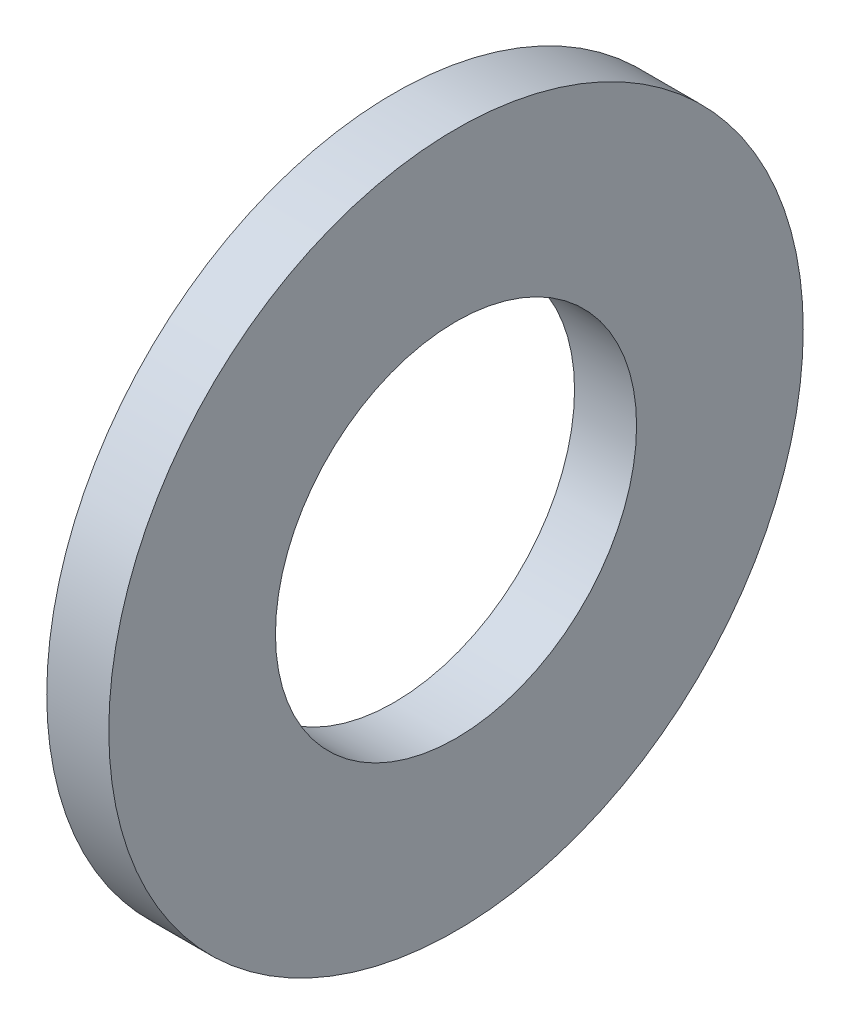
ISO-10303-21;
HEADER;
FILE_DESCRIPTION(('STEP AP214'),'2;1');
FILE_NAME('part.step','',(''),(''),'','','');
FILE_SCHEMA(('AUTOMOTIVE_DESIGN { 1 0 10303 214 1 1 1 1 }'));
ENDSEC;
DATA;
#1=APPLICATION_CONTEXT('core data for automotive mechanical design processes');
#2=APPLICATION_PROTOCOL_DEFINITION('international standard','automotive_design',2000,#1);
#3=PRODUCT_CONTEXT('',#1,'mechanical');
#4=PRODUCT('Part','Part','',(#3));
#5=PRODUCT_RELATED_PRODUCT_CATEGORY('part','',(#4));
#6=PRODUCT_DEFINITION_FORMATION('','',#4);
#7=PRODUCT_DEFINITION_CONTEXT('part definition',#1,'design');
#8=PRODUCT_DEFINITION('design','',#6,#7);
#9=PRODUCT_DEFINITION_SHAPE('','',#8);
#10=(LENGTH_UNIT() NAMED_UNIT(*) SI_UNIT(.MILLI.,.METRE.));
#11=(NAMED_UNIT(*) PLANE_ANGLE_UNIT() SI_UNIT($,.RADIAN.));
#12=(NAMED_UNIT(*) SI_UNIT($,.STERADIAN.) SOLID_ANGLE_UNIT());
#13=UNCERTAINTY_MEASURE_WITH_UNIT(LENGTH_MEASURE(1.E-05),#10,'distance_accuracy_value','');
#14=(GEOMETRIC_REPRESENTATION_CONTEXT(3) GLOBAL_UNCERTAINTY_ASSIGNED_CONTEXT((#13)) GLOBAL_UNIT_ASSIGNED_CONTEXT((#10,
#11,#12)) REPRESENTATION_CONTEXT('',''));
#15=CARTESIAN_POINT('',(0.,0.,0.));
#16=DIRECTION('',(0.,0.,1.));
#17=DIRECTION('',(1.,0.,0.));
#18=AXIS2_PLACEMENT_3D('',#15,#16,#17);
#19=CARTESIAN_POINT('',(1.7018,0.,0.));
#20=DIRECTION('',(1.,0.,0.));
#21=DIRECTION('',(0.,0.,-1.));
#22=AXIS2_PLACEMENT_3D('',#19,#20,#21);
#23=PLANE('',#22);
#24=CARTESIAN_POINT('',(1.7018,0.,0.));
#25=DIRECTION('',(1.,0.,0.));
#26=DIRECTION('',(0.,0.,-1.));
#27=AXIS2_PLACEMENT_3D('',#24,#25,#26);
#28=CIRCLE('',#27,9.525);
#29=CARTESIAN_POINT('',(1.7018,0.,-9.525));
#30=VERTEX_POINT('',#29);
#31=EDGE_CURVE('E10',#30,#30,#28,.T.);
#32=ORIENTED_EDGE('',*,*,#31,.T.);
#33=EDGE_LOOP('',(#32));
#34=FACE_BOUND('',#33,.T.);
#35=CARTESIAN_POINT('',(1.7018,0.,0.));
#36=DIRECTION('',(1.,0.,0.));
#37=DIRECTION('',(0.,0.,-1.));
#38=AXIS2_PLACEMENT_3D('',#35,#36,#37);
#39=CIRCLE('',#38,4.953);
#40=CARTESIAN_POINT('',(1.7018,0.,-4.953));
#41=VERTEX_POINT('',#40);
#42=EDGE_CURVE('E40',#41,#41,#39,.T.);
#43=ORIENTED_EDGE('',*,*,#42,.F.);
#44=EDGE_LOOP('',(#43));
#45=FACE_BOUND('',#44,.T.);
#46=ADVANCED_FACE('F29',(#34,#45),#23,.T.);
#47=CARTESIAN_POINT('',(0.,0.,0.));
#48=DIRECTION('',(1.,0.,0.));
#49=DIRECTION('',(0.,0.,-1.));
#50=AXIS2_PLACEMENT_3D('',#47,#48,#49);
#51=PLANE('',#50);
#52=CARTESIAN_POINT('',(0.,0.,0.));
#53=DIRECTION('',(1.,0.,0.));
#54=DIRECTION('',(0.,0.,-1.));
#55=AXIS2_PLACEMENT_3D('',#52,#53,#54);
#56=CIRCLE('',#55,9.525);
#57=CARTESIAN_POINT('',(0.,0.,-9.525));
#58=VERTEX_POINT('',#57);
#59=EDGE_CURVE('E33',#58,#58,#56,.T.);
#60=ORIENTED_EDGE('',*,*,#59,.F.);
#61=EDGE_LOOP('',(#60));
#62=FACE_BOUND('',#61,.T.);
#63=CARTESIAN_POINT('',(0.,0.,0.));
#64=DIRECTION('',(1.,0.,0.));
#65=DIRECTION('',(0.,0.,-1.));
#66=AXIS2_PLACEMENT_3D('',#63,#64,#65);
#67=CIRCLE('',#66,4.953);
#68=CARTESIAN_POINT('',(0.,0.,-4.953));
#69=VERTEX_POINT('',#68);
#70=EDGE_CURVE('E42',#69,#69,#67,.T.);
#71=ORIENTED_EDGE('',*,*,#70,.T.);
#72=EDGE_LOOP('',(#71));
#73=FACE_BOUND('',#72,.T.);
#74=ADVANCED_FACE('F52',(#62,#73),#51,.F.);
#75=CARTESIAN_POINT('',(1.7018,0.,0.));
#76=DIRECTION('',(-1.,0.,0.));
#77=DIRECTION('',(0.,0.,1.));
#78=AXIS2_PLACEMENT_3D('',#75,#76,#77);
#79=CYLINDRICAL_SURFACE('',#78,9.525);
#80=ORIENTED_EDGE('',*,*,#31,.F.);
#81=EDGE_LOOP('',(#80));
#82=FACE_BOUND('',#81,.T.);
#83=ORIENTED_EDGE('',*,*,#59,.T.);
#84=EDGE_LOOP('',(#83));
#85=FACE_BOUND('',#84,.T.);
#86=ADVANCED_FACE('F31',(#82,#85),#79,.T.);
#87=CARTESIAN_POINT('',(1.7018,0.,0.));
#88=DIRECTION('',(-1.,0.,0.));
#89=DIRECTION('',(0.,0.,1.));
#90=AXIS2_PLACEMENT_3D('',#87,#88,#89);
#91=CYLINDRICAL_SURFACE('',#90,4.953);
#92=ORIENTED_EDGE('',*,*,#42,.T.);
#93=EDGE_LOOP('',(#92));
#94=FACE_BOUND('',#93,.T.);
#95=ORIENTED_EDGE('',*,*,#70,.F.);
#96=EDGE_LOOP('',(#95));
#97=FACE_BOUND('',#96,.T.);
#98=ADVANCED_FACE('F48',(#94,#97),#91,.F.);
#99=CLOSED_SHELL('',(#46,#74,#86,#98));
#100=MANIFOLD_SOLID_BREP('B2',#99);
#101=ADVANCED_BREP_SHAPE_REPRESENTATION('',(#18,#100),#14);
#102=SHAPE_DEFINITION_REPRESENTATION(#9,#101);
ENDSEC;
END-ISO-10303-21;
